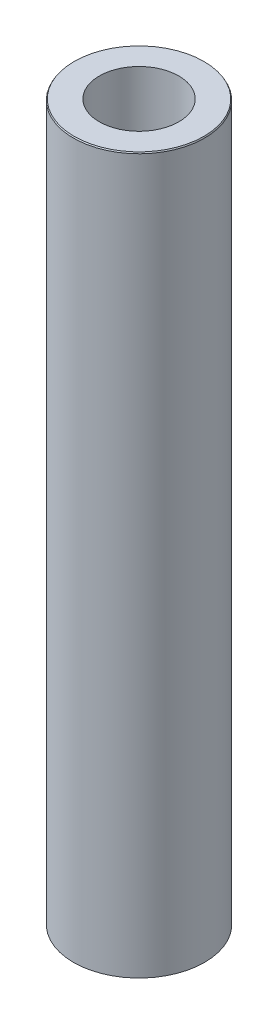
ISO-10303-21;
HEADER;
FILE_DESCRIPTION(('STEP AP214'),'2;1');
FILE_NAME('part.step','',(''),(''),'','','');
FILE_SCHEMA(('AUTOMOTIVE_DESIGN { 1 0 10303 214 1 1 1 1 }'));
ENDSEC;
DATA;
#1=APPLICATION_CONTEXT('core data for automotive mechanical design processes');
#2=APPLICATION_PROTOCOL_DEFINITION('international standard','automotive_design',2000,#1);
#3=PRODUCT_CONTEXT('',#1,'mechanical');
#4=PRODUCT('Part','Part','',(#3));
#5=PRODUCT_RELATED_PRODUCT_CATEGORY('part','',(#4));
#6=PRODUCT_DEFINITION_FORMATION('','',#4);
#7=PRODUCT_DEFINITION_CONTEXT('part definition',#1,'design');
#8=PRODUCT_DEFINITION('design','',#6,#7);
#9=PRODUCT_DEFINITION_SHAPE('','',#8);
#10=(LENGTH_UNIT() NAMED_UNIT(*) SI_UNIT(.MILLI.,.METRE.));
#11=(NAMED_UNIT(*) PLANE_ANGLE_UNIT() SI_UNIT($,.RADIAN.));
#12=(NAMED_UNIT(*) SI_UNIT($,.STERADIAN.) SOLID_ANGLE_UNIT());
#13=UNCERTAINTY_MEASURE_WITH_UNIT(LENGTH_MEASURE(1.E-05),#10,'distance_accuracy_value','');
#14=(GEOMETRIC_REPRESENTATION_CONTEXT(3) GLOBAL_UNCERTAINTY_ASSIGNED_CONTEXT((#13)) GLOBAL_UNIT_ASSIGNED_CONTEXT((#10,
#11,#12)) REPRESENTATION_CONTEXT('',''));
#15=CARTESIAN_POINT('',(0.,0.,0.));
#16=DIRECTION('',(0.,0.,1.));
#17=DIRECTION('',(1.,0.,0.));
#18=AXIS2_PLACEMENT_3D('',#15,#16,#17);
#19=CARTESIAN_POINT('',(0.,190.997646680199,0.));
#20=DIRECTION('',(0.,-1.,0.));
#21=DIRECTION('',(0.,0.,-1.));
#22=AXIS2_PLACEMENT_3D('',#19,#20,#21);
#23=CYLINDRICAL_SURFACE('',#22,17.5);
#24=CARTESIAN_POINT('',(0.,190.68087758283,0.));
#25=DIRECTION('',(0.,1.,0.));
#26=DIRECTION('',(0.,0.,1.));
#27=AXIS2_PLACEMENT_3D('',#24,#25,#26);
#28=CIRCLE('',#27,17.5);
#29=CARTESIAN_POINT('',(0.,190.68087758283,-17.5));
#30=VERTEX_POINT('',#29);
#31=EDGE_CURVE('E50',#30,#30,#28,.F.);
#32=CARTESIAN_POINT('',(0.,0.18288672363731,0.));
#33=DIRECTION('',(0.,1.,0.));
#34=DIRECTION('',(0.,0.,1.));
#35=AXIS2_PLACEMENT_3D('',#32,#33,#34);
#36=CIRCLE('',#35,17.5);
#37=CARTESIAN_POINT('',(0.,0.182886723637282,-17.5));
#38=VERTEX_POINT('',#37);
#39=EDGE_CURVE('E51',#38,#38,#36,.T.);
#40=CARTESIAN_POINT('',(0.,190.68087758283,-17.5));
#41=CARTESIAN_POINT('',(0.,188.69652351138,-17.5));
#42=CARTESIAN_POINT('',(0.,186.71216943993,-17.5));
#43=CARTESIAN_POINT('',(0.,182.74346129703,-17.5));
#44=CARTESIAN_POINT('',(0.,180.75910722558,-17.5));
#45=CARTESIAN_POINT('',(0.,176.79039908268,-17.5));
#46=CARTESIAN_POINT('',(0.,174.80604501123,-17.5));
#47=CARTESIAN_POINT('',(0.,170.83733686833,-17.5));
#48=CARTESIAN_POINT('',(0.,168.852982796881,-17.5));
#49=CARTESIAN_POINT('',(0.,164.884274653981,-17.5));
#50=CARTESIAN_POINT('',(0.,162.899920582531,-17.5));
#51=CARTESIAN_POINT('',(0.,158.931212439631,-17.5));
#52=CARTESIAN_POINT('',(0.,156.946858368181,-17.5));
#53=CARTESIAN_POINT('',(0.,152.978150225281,-17.5));
#54=CARTESIAN_POINT('',(0.,150.993796153831,-17.5));
#55=CARTESIAN_POINT('',(0.,147.025088010931,-17.5));
#56=CARTESIAN_POINT('',(0.,145.040733939481,-17.5));
#57=CARTESIAN_POINT('',(0.,141.072025796582,-17.5));
#58=CARTESIAN_POINT('',(0.,139.087671725132,-17.5));
#59=CARTESIAN_POINT('',(0.,135.118963582232,-17.5));
#60=CARTESIAN_POINT('',(0.,133.134609510782,-17.5));
#61=CARTESIAN_POINT('',(0.,129.165901367882,-17.5));
#62=CARTESIAN_POINT('',(0.,127.181547296432,-17.5));
#63=CARTESIAN_POINT('',(0.,123.212839153532,-17.5));
#64=CARTESIAN_POINT('',(0.,121.228485082082,-17.5));
#65=CARTESIAN_POINT('',(0.,117.259776939183,-17.5));
#66=CARTESIAN_POINT('',(0.,115.275422867733,-17.5));
#67=CARTESIAN_POINT('',(0.,111.306714724833,-17.5));
#68=CARTESIAN_POINT('',(0.,109.322360653383,-17.5));
#69=CARTESIAN_POINT('',(0.,105.353652510483,-17.5));
#70=CARTESIAN_POINT('',(0.,103.369298439033,-17.5));
#71=CARTESIAN_POINT('',(0.,99.4005902961333,-17.5));
#72=CARTESIAN_POINT('',(0.,97.4162362246834,-17.5));
#73=CARTESIAN_POINT('',(0.,93.4475280817836,-17.5));
#74=CARTESIAN_POINT('',(0.,91.4631740103336,-17.5));
#75=CARTESIAN_POINT('',(0.,87.4944658674338,-17.5));
#76=CARTESIAN_POINT('',(0.,85.5101117959839,-17.5));
#77=CARTESIAN_POINT('',(0.,81.541403653084,-17.5));
#78=CARTESIAN_POINT('',(0.,79.5570495816341,-17.5));
#79=CARTESIAN_POINT('',(0.,75.5883414387343,-17.5));
#80=CARTESIAN_POINT('',(0.,73.6039873672843,-17.5));
#81=CARTESIAN_POINT('',(0.,69.6352792243845,-17.5));
#82=CARTESIAN_POINT('',(0.,67.6509251529346,-17.5));
#83=CARTESIAN_POINT('',(0.,63.6822170100348,-17.5));
#84=CARTESIAN_POINT('',(0.,61.6978629385848,-17.5));
#85=CARTESIAN_POINT('',(0.,57.729154795685,-17.5));
#86=CARTESIAN_POINT('',(0.,55.7448007242351,-17.5));
#87=CARTESIAN_POINT('',(0.,51.7760925813352,-17.5));
#88=CARTESIAN_POINT('',(0.,49.7917385098853,-17.5));
#89=CARTESIAN_POINT('',(0.,45.8230303669855,-17.5));
#90=CARTESIAN_POINT('',(0.,43.8386762955355,-17.5));
#91=CARTESIAN_POINT('',(0.,39.8699681526357,-17.5));
#92=CARTESIAN_POINT('',(0.,37.8856140811858,-17.5));
#93=CARTESIAN_POINT('',(0.,33.9169059382859,-17.5));
#94=CARTESIAN_POINT('',(0.,31.932551866836,-17.5));
#95=CARTESIAN_POINT('',(0.,27.9638437239362,-17.5));
#96=CARTESIAN_POINT('',(0.,25.9794896524863,-17.5));
#97=CARTESIAN_POINT('',(0.,22.0107815095864,-17.5));
#98=CARTESIAN_POINT('',(0.,20.0264274381365,-17.5));
#99=CARTESIAN_POINT('',(0.,16.0577192952367,-17.5));
#100=CARTESIAN_POINT('',(0.,14.0733652237867,-17.5));
#101=CARTESIAN_POINT('',(0.,10.1046570808869,-17.5));
#102=CARTESIAN_POINT('',(0.,8.12030300943697,-17.5));
#103=CARTESIAN_POINT('',(0.,4.15159486653713,-17.5));
#104=CARTESIAN_POINT('',(0.,2.16724079508721,-17.5));
#105=CARTESIAN_POINT('',(0.,0.182886723637282,-17.5));
#106=B_SPLINE_CURVE_WITH_KNOTS('',3,(#40,#41,#42,#43,#44,#45,#46,#47,#48,#49,#50,#51,#52,#53,
#54,#55,#56,#57,#58,#59,#60,#61,#62,#63,#64,#65,#66,#67,#68,#69,#70,#71,#72,#73,#74,#75,#76,#77,
#78,#79,#80,#81,#82,#83,#84,#85,#86,#87,#88,#89,#90,#91,#92,#93,#94,#95,#96,#97,#98,#99,#100,
#101,#102,#103,#104,#105),.UNSPECIFIED.,.F.,.F.,(4,2,2,2,2,2,2,2,2,2,2,2,2,2,2,2,2,2,2,2,2,2,2,
2,2,2,2,2,2,2,2,2,4),(0.,5.95306221434977,11.9061244286995,17.8591866430493,23.812248857399,
29.7653110717488,35.7183732860986,41.6714355004484,47.6244977147981,53.5775599291479,
59.5306221434976,65.4836843578474,71.4367465721972,77.3898087865469,83.3428710008967,
89.2959332152464,95.2489954295962,101.202057643946,107.155119858296,113.108182072645,
119.061244286995,125.014306501345,130.967368715695,136.920430930045,142.873493144394,
148.826555358744,154.779617573094,160.732679787444,166.685742001793,172.638804216143,
178.591866430493,184.544928644843,190.497990859192),.UNSPECIFIED.);
#107=EDGE_CURVE('BSEAM39',#30,#38,#106,.T.);
#108=ORIENTED_EDGE('',*,*,#31,.T.);
#109=ORIENTED_EDGE('',*,*,#39,.T.);
#110=ORIENTED_EDGE('',*,*,#107,.T.);
#111=ORIENTED_EDGE('',*,*,#107,.F.);
#112=EDGE_LOOP('',(#108,#110,#109,#111));
#113=FACE_BOUND('',#112,.T.);
#114=ADVANCED_FACE('F39',(#113),#23,.T.);
#115=CARTESIAN_POINT('',(0.,190.997646680199,0.));
#116=DIRECTION('',(0.,1.,0.));
#117=DIRECTION('',(0.,0.,1.));
#118=AXIS2_PLACEMENT_3D('',#115,#116,#117);
#119=PLANE('',#118);
#120=CARTESIAN_POINT('',(0.,190.997646680199,0.));
#121=DIRECTION('',(0.,1.,0.));
#122=DIRECTION('',(0.,0.,1.));
#123=AXIS2_PLACEMENT_3D('',#120,#121,#122);
#124=CIRCLE('',#123,17.3171132763628);
#125=CARTESIAN_POINT('',(0.,190.997646680199,17.3171132763628));
#126=VERTEX_POINT('',#125);
#127=EDGE_CURVE('E54',#126,#126,#124,.T.);
#128=ORIENTED_EDGE('',*,*,#127,.T.);
#129=EDGE_LOOP('',(#128));
#130=FACE_BOUND('',#129,.T.);
#131=CARTESIAN_POINT('',(0.,190.997646680199,0.));
#132=DIRECTION('',(0.,1.,0.));
#133=DIRECTION('',(0.,0.,1.));
#134=AXIS2_PLACEMENT_3D('',#131,#132,#133);
#135=CIRCLE('',#134,10.6064535529387);
#136=CARTESIAN_POINT('',(0.,190.997646680199,-10.6064535529387));
#137=VERTEX_POINT('',#136);
#138=EDGE_CURVE('E58',#137,#137,#135,.T.);
#139=ORIENTED_EDGE('',*,*,#138,.F.);
#140=EDGE_LOOP('',(#139));
#141=FACE_BOUND('',#140,.T.);
#142=ADVANCED_FACE('F69',(#130,#141),#119,.T.);
#143=CARTESIAN_POINT('',(0.,0.,0.));
#144=DIRECTION('',(0.,1.,0.));
#145=DIRECTION('',(0.,0.,1.));
#146=AXIS2_PLACEMENT_3D('',#143,#144,#145);
#147=PLANE('',#146);
#148=CARTESIAN_POINT('',(0.,0.,0.));
#149=DIRECTION('',(0.,1.,0.));
#150=DIRECTION('',(0.,0.,1.));
#151=AXIS2_PLACEMENT_3D('',#148,#149,#150);
#152=CIRCLE('',#151,17.1832309026304);
#153=CARTESIAN_POINT('',(0.,0.,17.1832309026304));
#154=VERTEX_POINT('',#153);
#155=EDGE_CURVE('E10',#154,#154,#152,.F.);
#156=ORIENTED_EDGE('',*,*,#155,.T.);
#157=EDGE_LOOP('',(#156));
#158=FACE_BOUND('',#157,.T.);
#159=CARTESIAN_POINT('',(0.,0.,0.));
#160=DIRECTION('',(0.,1.,0.));
#161=DIRECTION('',(0.,0.,1.));
#162=AXIS2_PLACEMENT_3D('',#159,#160,#161);
#163=CIRCLE('',#162,10.6064535529387);
#164=CARTESIAN_POINT('',(0.,0.,-10.6064535529387));
#165=VERTEX_POINT('',#164);
#166=EDGE_CURVE('E63',#165,#165,#163,.T.);
#167=ORIENTED_EDGE('',*,*,#166,.T.);
#168=EDGE_LOOP('',(#167));
#169=FACE_BOUND('',#168,.T.);
#170=ADVANCED_FACE('F75',(#158,#169),#147,.F.);
#171=CARTESIAN_POINT('',(0.,190.997646680199,0.));
#172=DIRECTION('',(0.,-1.,0.));
#173=DIRECTION('',(0.,0.,-1.));
#174=AXIS2_PLACEMENT_3D('',#171,#172,#173);
#175=CYLINDRICAL_SURFACE('',#174,10.6064535529387);
#176=CARTESIAN_POINT('',(0.,190.997646680199,-10.6064535529387));
#177=CARTESIAN_POINT('',(0.,189.008087860614,-10.6064535529387));
#178=CARTESIAN_POINT('',(0.,187.018529041028,-10.6064535529387));
#179=CARTESIAN_POINT('',(0.,183.039411401857,-10.6064535529387));
#180=CARTESIAN_POINT('',(0.,181.049852582272,-10.6064535529387));
#181=CARTESIAN_POINT('',(0.,177.070734943101,-10.6064535529387));
#182=CARTESIAN_POINT('',(0.,175.081176123516,-10.6064535529387));
#183=CARTESIAN_POINT('',(0.,171.102058484345,-10.6064535529387));
#184=CARTESIAN_POINT('',(0.,169.11249966476,-10.6064535529387));
#185=CARTESIAN_POINT('',(0.,165.133382025589,-10.6064535529387));
#186=CARTESIAN_POINT('',(0.,163.143823206003,-10.6064535529387));
#187=CARTESIAN_POINT('',(0.,159.164705566833,-10.6064535529387));
#188=CARTESIAN_POINT('',(0.,157.175146747247,-10.6064535529387));
#189=CARTESIAN_POINT('',(0.,153.196029108076,-10.6064535529387));
#190=CARTESIAN_POINT('',(0.,151.206470288491,-10.6064535529387));
#191=CARTESIAN_POINT('',(0.,147.22735264932,-10.6064535529387));
#192=CARTESIAN_POINT('',(0.,145.237793829735,-10.6064535529387));
#193=CARTESIAN_POINT('',(0.,141.258676190564,-10.6064535529387));
#194=CARTESIAN_POINT('',(0.,139.269117370978,-10.6064535529387));
#195=CARTESIAN_POINT('',(0.,135.289999731808,-10.6064535529387));
#196=CARTESIAN_POINT('',(0.,133.300440912222,-10.6064535529387));
#197=CARTESIAN_POINT('',(0.,129.321323273051,-10.6064535529387));
#198=CARTESIAN_POINT('',(0.,127.331764453466,-10.6064535529387));
#199=CARTESIAN_POINT('',(0.,123.352646814295,-10.6064535529387));
#200=CARTESIAN_POINT('',(0.,121.36308799471,-10.6064535529387));
#201=CARTESIAN_POINT('',(0.,117.383970355539,-10.6064535529387));
#202=CARTESIAN_POINT('',(0.,115.394411535954,-10.6064535529387));
#203=CARTESIAN_POINT('',(0.,111.415293896783,-10.6064535529387));
#204=CARTESIAN_POINT('',(0.,109.425735077197,-10.6064535529387));
#205=CARTESIAN_POINT('',(0.,105.446617438027,-10.6064535529387));
#206=CARTESIAN_POINT('',(0.,103.457058618441,-10.6064535529387));
#207=CARTESIAN_POINT('',(0.,99.4779409792703,-10.6064535529387));
#208=CARTESIAN_POINT('',(0.,97.4883821596849,-10.6064535529387));
#209=CARTESIAN_POINT('',(0.,93.5092645205141,-10.6064535529387));
#210=CARTESIAN_POINT('',(0.,91.5197057009287,-10.6064535529387));
#211=CARTESIAN_POINT('',(0.,87.5405880617579,-10.6064535529387));
#212=CARTESIAN_POINT('',(0.,85.5510292421725,-10.6064535529387));
#213=CARTESIAN_POINT('',(0.,81.5719116030017,-10.6064535529387));
#214=CARTESIAN_POINT('',(0.,79.5823527834163,-10.6064535529387));
#215=CARTESIAN_POINT('',(0.,75.6032351442454,-10.6064535529387));
#216=CARTESIAN_POINT('',(0.,73.61367632466,-10.6064535529387));
#217=CARTESIAN_POINT('',(0.,69.6345586854892,-10.6064535529387));
#218=CARTESIAN_POINT('',(0.,67.6449998659038,-10.6064535529387));
#219=CARTESIAN_POINT('',(0.,63.665882226733,-10.6064535529387));
#220=CARTESIAN_POINT('',(0.,61.6763234071476,-10.6064535529387));
#221=CARTESIAN_POINT('',(0.,57.6972057679768,-10.6064535529387));
#222=CARTESIAN_POINT('',(0.,55.7076469483914,-10.6064535529387));
#223=CARTESIAN_POINT('',(0.,51.7285293092206,-10.6064535529387));
#224=CARTESIAN_POINT('',(0.,49.7389704896352,-10.6064535529387));
#225=CARTESIAN_POINT('',(0.,45.7598528504643,-10.6064535529387));
#226=CARTESIAN_POINT('',(0.,43.7702940308789,-10.6064535529387));
#227=CARTESIAN_POINT('',(0.,39.7911763917081,-10.6064535529387));
#228=CARTESIAN_POINT('',(0.,37.8016175721227,-10.6064535529387));
#229=CARTESIAN_POINT('',(0.,33.8224999329519,-10.6064535529387));
#230=CARTESIAN_POINT('',(0.,31.8329411133665,-10.6064535529387));
#231=CARTESIAN_POINT('',(0.,27.8538234741957,-10.6064535529387));
#232=CARTESIAN_POINT('',(0.,25.8642646546103,-10.6064535529387));
#233=CARTESIAN_POINT('',(0.,21.8851470154395,-10.6064535529387));
#234=CARTESIAN_POINT('',(0.,19.895588195854,-10.6064535529387));
#235=CARTESIAN_POINT('',(0.,15.9164705566832,-10.6064535529387));
#236=CARTESIAN_POINT('',(0.,13.9269117370978,-10.6064535529387));
#237=CARTESIAN_POINT('',(0.,9.94779409792701,-10.6064535529387));
#238=CARTESIAN_POINT('',(0.,7.95823527834161,-10.6064535529387));
#239=CARTESIAN_POINT('',(0.,3.97911763917079,-10.6064535529387));
#240=CARTESIAN_POINT('',(0.,1.98955881958538,-10.6064535529387));
#241=CARTESIAN_POINT('',(0.,0.,-10.6064535529387));
#242=B_SPLINE_CURVE_WITH_KNOTS('',3,(#176,#177,#178,#179,#180,#181,#182,#183,#184,#185,#186,
#187,#188,#189,#190,#191,#192,#193,#194,#195,#196,#197,#198,#199,#200,#201,#202,#203,#204,#205,
#206,#207,#208,#209,#210,#211,#212,#213,#214,#215,#216,#217,#218,#219,#220,#221,#222,#223,#224,
#225,#226,#227,#228,#229,#230,#231,#232,#233,#234,#235,#236,#237,#238,#239,#240,#241),
.UNSPECIFIED.,.F.,.F.,(4,2,2,2,2,2,2,2,2,2,2,2,2,2,2,2,2,2,2,2,2,2,2,2,2,2,2,2,2,2,2,2,4),(0.,
5.96867645875623,11.9373529175125,17.9060293762687,23.8747058350249,29.8433822937811,
35.8120587525373,41.7807352112936,47.7494116700498,53.718088128806,59.6867645875622,
65.6554410463185,71.6241175050747,77.5927939638309,83.5614704225871,89.5301468813434,
95.4988233400996,101.467499798856,107.436176257612,113.404852716368,119.373529175124,
125.342205633881,131.310882092637,137.279558551393,143.248235010149,149.216911468906,
155.185587927662,161.154264386418,167.122940845174,173.09161730393,179.060293762687,
185.028970221443,190.997646680199),.UNSPECIFIED.);
#243=EDGE_CURVE('BSEAM70',#137,#165,#242,.T.);
#244=ORIENTED_EDGE('',*,*,#138,.T.);
#245=ORIENTED_EDGE('',*,*,#166,.F.);
#246=ORIENTED_EDGE('',*,*,#243,.T.);
#247=ORIENTED_EDGE('',*,*,#243,.F.);
#248=EDGE_LOOP('',(#244,#246,#245,#247));
#249=FACE_BOUND('',#248,.T.);
#250=ADVANCED_FACE('F70',(#249),#175,.F.);
#251=CARTESIAN_POINT('',(0.,190.997646680199,0.));
#252=DIRECTION('',(0.,-1.,0.));
#253=DIRECTION('',(0.,0.,-1.));
#254=AXIS2_PLACEMENT_3D('',#251,#252,#253);
#255=CONICAL_SURFACE('',#254,17.3171132763628,0.523598775598307);
#256=ORIENTED_EDGE('',*,*,#31,.F.);
#257=EDGE_LOOP('',(#256));
#258=FACE_BOUND('',#257,.T.);
#259=ORIENTED_EDGE('',*,*,#127,.F.);
#260=EDGE_LOOP('',(#259));
#261=FACE_BOUND('',#260,.T.);
#262=ADVANCED_FACE('F81',(#258,#261),#255,.T.);
#263=CARTESIAN_POINT('',(0.,0.18288672363731,0.));
#264=DIRECTION('',(0.,1.,0.));
#265=DIRECTION('',(0.,0.,1.));
#266=AXIS2_PLACEMENT_3D('',#263,#264,#265);
#267=CONICAL_SURFACE('',#266,17.5,1.04719755119663);
#268=ORIENTED_EDGE('',*,*,#155,.F.);
#269=EDGE_LOOP('',(#268));
#270=FACE_BOUND('',#269,.T.);
#271=ORIENTED_EDGE('',*,*,#39,.F.);
#272=EDGE_LOOP('',(#271));
#273=FACE_BOUND('',#272,.T.);
#274=ADVANCED_FACE('F45',(#270,#273),#267,.T.);
#275=CLOSED_SHELL('',(#114,#142,#170,#250,#262,#274));
#276=MANIFOLD_SOLID_BREP('B2',#275);
#277=ADVANCED_BREP_SHAPE_REPRESENTATION('',(#18,#276),#14);
#278=SHAPE_DEFINITION_REPRESENTATION(#9,#277);
ENDSEC;
END-ISO-10303-21;
